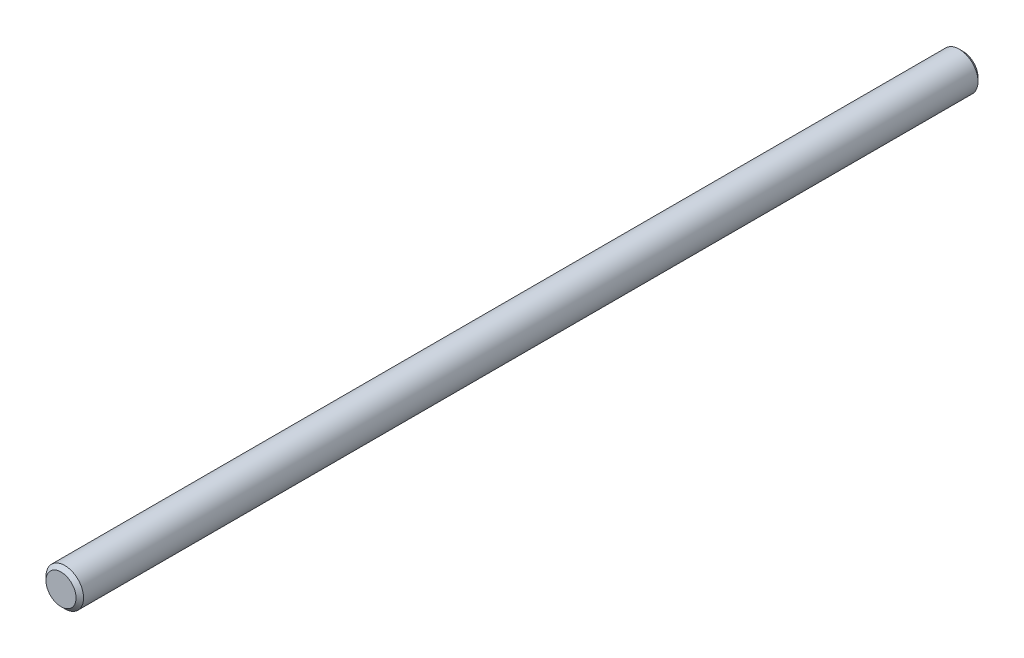
ISO-10303-21;
HEADER;
FILE_DESCRIPTION(('STEP AP214'),'2;1');
FILE_NAME('part.step','',(''),(''),'','','');
FILE_SCHEMA(('AUTOMOTIVE_DESIGN { 1 0 10303 214 1 1 1 1 }'));
ENDSEC;
DATA;
#1=APPLICATION_CONTEXT('core data for automotive mechanical design processes');
#2=APPLICATION_PROTOCOL_DEFINITION('international standard','automotive_design',2000,#1);
#3=PRODUCT_CONTEXT('',#1,'mechanical');
#4=PRODUCT('Part','Part','',(#3));
#5=PRODUCT_RELATED_PRODUCT_CATEGORY('part','',(#4));
#6=PRODUCT_DEFINITION_FORMATION('','',#4);
#7=PRODUCT_DEFINITION_CONTEXT('part definition',#1,'design');
#8=PRODUCT_DEFINITION('design','',#6,#7);
#9=PRODUCT_DEFINITION_SHAPE('','',#8);
#10=(LENGTH_UNIT() NAMED_UNIT(*) SI_UNIT(.MILLI.,.METRE.));
#11=(NAMED_UNIT(*) PLANE_ANGLE_UNIT() SI_UNIT($,.RADIAN.));
#12=(NAMED_UNIT(*) SI_UNIT($,.STERADIAN.) SOLID_ANGLE_UNIT());
#13=UNCERTAINTY_MEASURE_WITH_UNIT(LENGTH_MEASURE(1.E-05),#10,'distance_accuracy_value','');
#14=(GEOMETRIC_REPRESENTATION_CONTEXT(3) GLOBAL_UNCERTAINTY_ASSIGNED_CONTEXT((#13)) GLOBAL_UNIT_ASSIGNED_CONTEXT((#10,
#11,#12)) REPRESENTATION_CONTEXT('',''));
#15=CARTESIAN_POINT('',(0.,0.,0.));
#16=DIRECTION('',(0.,0.,1.));
#17=DIRECTION('',(1.,0.,0.));
#18=AXIS2_PLACEMENT_3D('',#15,#16,#17);
#19=CARTESIAN_POINT('',(0.,0.,38.1));
#20=DIRECTION('',(0.,0.,-1.));
#21=DIRECTION('',(-1.,0.,0.));
#22=AXIS2_PLACEMENT_3D('',#19,#20,#21);
#23=CYLINDRICAL_SURFACE('',#22,1.5875);
#24=CARTESIAN_POINT('',(0.,0.,-37.7824999999999));
#25=DIRECTION('',(0.,0.,1.));
#26=DIRECTION('',(1.,0.,0.));
#27=AXIS2_PLACEMENT_3D('',#24,#25,#26);
#28=CIRCLE('',#27,1.5875);
#29=CARTESIAN_POINT('',(1.5875,0.,-37.7824999999999));
#30=VERTEX_POINT('',#29);
#31=EDGE_CURVE('E44',#30,#30,#28,.T.);
#32=ORIENTED_EDGE('',*,*,#31,.T.);
#33=EDGE_LOOP('',(#32));
#34=FACE_BOUND('',#33,.T.);
#35=CARTESIAN_POINT('',(0.,0.,37.7825));
#36=DIRECTION('',(0.,0.,1.));
#37=DIRECTION('',(1.,0.,0.));
#38=AXIS2_PLACEMENT_3D('',#35,#36,#37);
#39=CIRCLE('',#38,1.5875);
#40=CARTESIAN_POINT('',(1.5875,0.,37.7825));
#41=VERTEX_POINT('',#40);
#42=EDGE_CURVE('E48',#41,#41,#39,.F.);
#43=ORIENTED_EDGE('',*,*,#42,.T.);
#44=EDGE_LOOP('',(#43));
#45=FACE_BOUND('',#44,.T.);
#46=ADVANCED_FACE('F33',(#34,#45),#23,.T.);
#47=CARTESIAN_POINT('',(0.,0.,38.1));
#48=DIRECTION('',(0.,0.,1.));
#49=DIRECTION('',(1.,0.,0.));
#50=AXIS2_PLACEMENT_3D('',#47,#48,#49);
#51=PLANE('',#50);
#52=CARTESIAN_POINT('',(0.,0.,38.1));
#53=DIRECTION('',(0.,0.,1.));
#54=DIRECTION('',(1.,0.,0.));
#55=AXIS2_PLACEMENT_3D('',#52,#53,#54);
#56=CIRCLE('',#55,1.27000000000004);
#57=CARTESIAN_POINT('',(1.27000000000004,0.,38.1));
#58=VERTEX_POINT('',#57);
#59=EDGE_CURVE('E10',#58,#58,#56,.T.);
#60=ORIENTED_EDGE('',*,*,#59,.T.);
#61=EDGE_LOOP('',(#60));
#62=FACE_BOUND('',#61,.T.);
#63=ADVANCED_FACE('F64',(#62),#51,.T.);
#64=CARTESIAN_POINT('',(0.,0.,-38.1));
#65=DIRECTION('',(0.,0.,1.));
#66=DIRECTION('',(1.,0.,0.));
#67=AXIS2_PLACEMENT_3D('',#64,#65,#66);
#68=PLANE('',#67);
#69=CARTESIAN_POINT('',(0.,0.,-38.1));
#70=DIRECTION('',(0.,0.,1.));
#71=DIRECTION('',(1.,0.,0.));
#72=AXIS2_PLACEMENT_3D('',#69,#70,#71);
#73=CIRCLE('',#72,1.26999999999994);
#74=CARTESIAN_POINT('',(1.26999999999994,0.,-38.1));
#75=VERTEX_POINT('',#74);
#76=EDGE_CURVE('E40',#75,#75,#73,.F.);
#77=ORIENTED_EDGE('',*,*,#76,.T.);
#78=EDGE_LOOP('',(#77));
#79=FACE_BOUND('',#78,.T.);
#80=ADVANCED_FACE('F61',(#79),#68,.F.);
#81=CARTESIAN_POINT('',(0.,0.,-37.7824999999999));
#82=DIRECTION('',(0.,0.,1.));
#83=DIRECTION('',(1.,0.,0.));
#84=AXIS2_PLACEMENT_3D('',#81,#82,#83);
#85=CONICAL_SURFACE('',#84,1.5875,0.78539816339744);
#86=ORIENTED_EDGE('',*,*,#76,.F.);
#87=EDGE_LOOP('',(#86));
#88=FACE_BOUND('',#87,.T.);
#89=ORIENTED_EDGE('',*,*,#31,.F.);
#90=EDGE_LOOP('',(#89));
#91=FACE_BOUND('',#90,.T.);
#92=ADVANCED_FACE('F57',(#88,#91),#85,.T.);
#93=CARTESIAN_POINT('',(0.,0.,38.1));
#94=DIRECTION('',(0.,0.,-1.));
#95=DIRECTION('',(-1.,0.,0.));
#96=AXIS2_PLACEMENT_3D('',#93,#94,#95);
#97=CONICAL_SURFACE('',#96,1.27000000000004,0.785398163397451);
#98=ORIENTED_EDGE('',*,*,#42,.F.);
#99=EDGE_LOOP('',(#98));
#100=FACE_BOUND('',#99,.T.);
#101=ORIENTED_EDGE('',*,*,#59,.F.);
#102=EDGE_LOOP('',(#101));
#103=FACE_BOUND('',#102,.T.);
#104=ADVANCED_FACE('F35',(#100,#103),#97,.T.);
#105=CLOSED_SHELL('',(#46,#63,#80,#92,#104));
#106=MANIFOLD_SOLID_BREP('B2',#105);
#107=ADVANCED_BREP_SHAPE_REPRESENTATION('',(#18,#106),#14);
#108=SHAPE_DEFINITION_REPRESENTATION(#9,#107);
ENDSEC;
END-ISO-10303-21;
